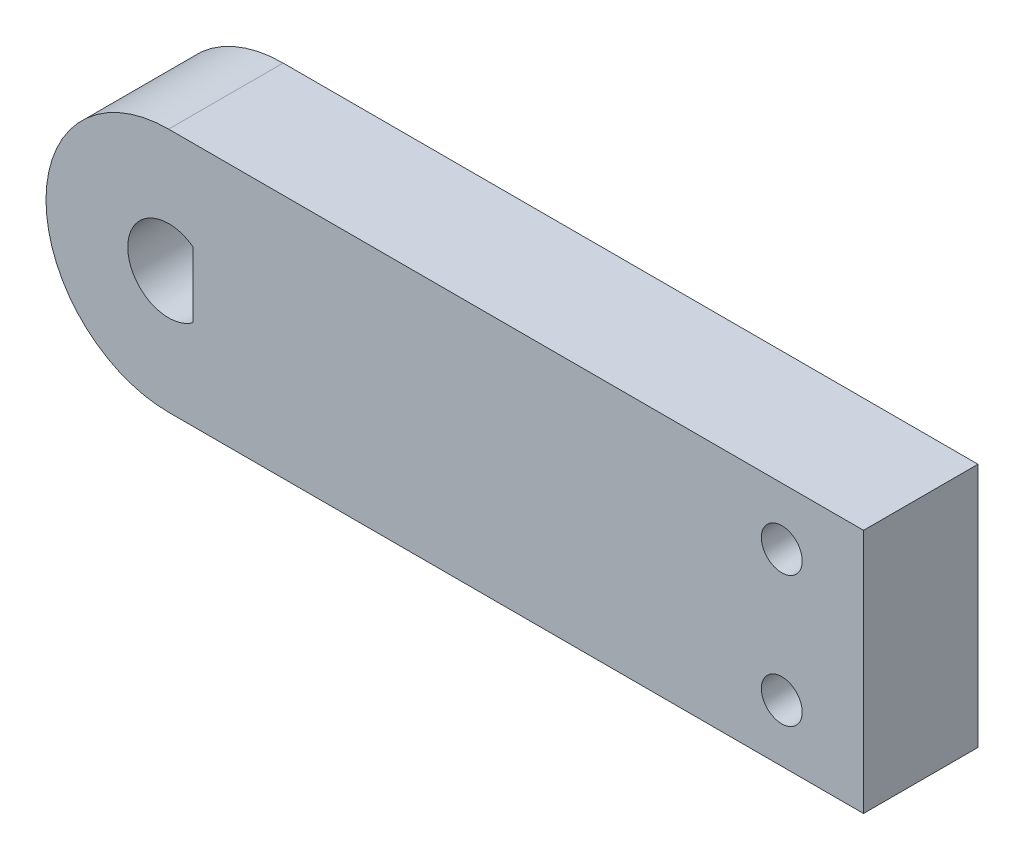
ISO-10303-21;
HEADER;
FILE_DESCRIPTION(('STEP AP214'),'2;1');
FILE_NAME('part.step','',(''),(''),'','','');
FILE_SCHEMA(('AUTOMOTIVE_DESIGN { 1 0 10303 214 1 1 1 1 }'));
ENDSEC;
DATA;
#1=APPLICATION_CONTEXT('core data for automotive mechanical design processes');
#2=APPLICATION_PROTOCOL_DEFINITION('international standard','automotive_design',2000,#1);
#3=PRODUCT_CONTEXT('',#1,'mechanical');
#4=PRODUCT('Part','Part','',(#3));
#5=PRODUCT_RELATED_PRODUCT_CATEGORY('part','',(#4));
#6=PRODUCT_DEFINITION_FORMATION('','',#4);
#7=PRODUCT_DEFINITION_CONTEXT('part definition',#1,'design');
#8=PRODUCT_DEFINITION('design','',#6,#7);
#9=PRODUCT_DEFINITION_SHAPE('','',#8);
#10=(LENGTH_UNIT() NAMED_UNIT(*) SI_UNIT(.MILLI.,.METRE.));
#11=(NAMED_UNIT(*) PLANE_ANGLE_UNIT() SI_UNIT($,.RADIAN.));
#12=(NAMED_UNIT(*) SI_UNIT($,.STERADIAN.) SOLID_ANGLE_UNIT());
#13=UNCERTAINTY_MEASURE_WITH_UNIT(LENGTH_MEASURE(1.E-05),#10,'distance_accuracy_value','');
#14=(GEOMETRIC_REPRESENTATION_CONTEXT(3) GLOBAL_UNCERTAINTY_ASSIGNED_CONTEXT((#13)) GLOBAL_UNIT_ASSIGNED_CONTEXT((#10,
#11,#12)) REPRESENTATION_CONTEXT('',''));
#15=CARTESIAN_POINT('',(0.,0.,0.));
#16=DIRECTION('',(0.,0.,1.));
#17=DIRECTION('',(1.,0.,0.));
#18=AXIS2_PLACEMENT_3D('',#15,#16,#17);
#19=CARTESIAN_POINT('',(31.75,-9.525,4.445));
#20=DIRECTION('',(-1.,0.,0.));
#21=DIRECTION('',(0.,0.,1.));
#22=AXIS2_PLACEMENT_3D('',#19,#20,#21);
#23=PLANE('',#22);
#24=DIRECTION('',(0.,1.,0.));
#25=VECTOR('',#24,1.);
#26=CARTESIAN_POINT('',(31.75,-9.525,-4.445));
#27=LINE('',#26,#25);
#28=CARTESIAN_POINT('',(31.75,-9.525,-4.445));
#29=VERTEX_POINT('',#28);
#30=CARTESIAN_POINT('',(31.75,9.525,-4.445));
#31=VERTEX_POINT('',#30);
#32=EDGE_CURVE('E148',#29,#31,#27,.T.);
#33=ORIENTED_EDGE('',*,*,#32,.T.);
#34=DIRECTION('',(0.,0.,-1.));
#35=VECTOR('',#34,1.);
#36=CARTESIAN_POINT('',(31.75,9.525,4.445));
#37=LINE('',#36,#35);
#38=CARTESIAN_POINT('',(31.75,9.525,4.445));
#39=VERTEX_POINT('',#38);
#40=EDGE_CURVE('E156',#39,#31,#37,.T.);
#41=ORIENTED_EDGE('',*,*,#40,.F.);
#42=DIRECTION('',(0.,1.,0.));
#43=VECTOR('',#42,1.);
#44=CARTESIAN_POINT('',(31.75,-9.525,4.445));
#45=LINE('',#44,#43);
#46=CARTESIAN_POINT('',(31.75,-9.525,4.445));
#47=VERTEX_POINT('',#46);
#48=EDGE_CURVE('E116',#47,#39,#45,.T.);
#49=ORIENTED_EDGE('',*,*,#48,.F.);
#50=DIRECTION('',(0.,0.,-1.));
#51=VECTOR('',#50,1.);
#52=CARTESIAN_POINT('',(31.75,-9.525,4.445));
#53=LINE('',#52,#51);
#54=EDGE_CURVE('E147',#47,#29,#53,.T.);
#55=ORIENTED_EDGE('',*,*,#54,.T.);
#56=EDGE_LOOP('',(#33,#41,#49,#55));
#57=FACE_BOUND('',#56,.T.);
#58=ADVANCED_FACE('F39',(#57),#23,.F.);
#59=CARTESIAN_POINT('',(-31.75,9.525,4.445));
#60=DIRECTION('',(0.,-1.,0.));
#61=DIRECTION('',(0.,0.,-1.));
#62=AXIS2_PLACEMENT_3D('',#59,#60,#61);
#63=PLANE('',#62);
#64=DIRECTION('',(-1.,0.,0.));
#65=VECTOR('',#64,1.);
#66=CARTESIAN_POINT('',(-31.75,9.525,-4.445));
#67=LINE('',#66,#65);
#68=CARTESIAN_POINT('',(-22.225,9.525,-4.445));
#69=VERTEX_POINT('',#68);
#70=EDGE_CURVE('E107',#31,#69,#67,.T.);
#71=ORIENTED_EDGE('',*,*,#70,.T.);
#72=DIRECTION('',(0.,0.,-1.));
#73=VECTOR('',#72,1.);
#74=CARTESIAN_POINT('',(-22.225,9.525,4.445));
#75=LINE('',#74,#73);
#76=CARTESIAN_POINT('',(-22.225,9.525,4.445));
#77=VERTEX_POINT('',#76);
#78=EDGE_CURVE('E11',#69,#77,#75,.F.);
#79=ORIENTED_EDGE('',*,*,#78,.T.);
#80=DIRECTION('',(-1.,0.,0.));
#81=VECTOR('',#80,1.);
#82=CARTESIAN_POINT('',(-31.75,9.525,4.445));
#83=LINE('',#82,#81);
#84=EDGE_CURVE('E105',#39,#77,#83,.T.);
#85=ORIENTED_EDGE('',*,*,#84,.F.);
#86=ORIENTED_EDGE('',*,*,#40,.T.);
#87=EDGE_LOOP('',(#71,#79,#85,#86));
#88=FACE_BOUND('',#87,.T.);
#89=ADVANCED_FACE('F103',(#88),#63,.F.);
#90=CARTESIAN_POINT('',(-31.75,-9.525,4.445));
#91=DIRECTION('',(0.,1.,0.));
#92=DIRECTION('',(0.,0.,1.));
#93=AXIS2_PLACEMENT_3D('',#90,#91,#92);
#94=PLANE('',#93);
#95=DIRECTION('',(1.,0.,0.));
#96=VECTOR('',#95,1.);
#97=CARTESIAN_POINT('',(-31.75,-9.525,4.445));
#98=LINE('',#97,#96);
#99=CARTESIAN_POINT('',(-22.225,-9.525,4.445));
#100=VERTEX_POINT('',#99);
#101=EDGE_CURVE('E118',#100,#47,#98,.T.);
#102=ORIENTED_EDGE('',*,*,#101,.F.);
#103=DIRECTION('',(0.,0.,-1.));
#104=VECTOR('',#103,1.);
#105=CARTESIAN_POINT('',(-22.225,-9.525,4.445));
#106=LINE('',#105,#104);
#107=CARTESIAN_POINT('',(-22.225,-9.525,-4.445));
#108=VERTEX_POINT('',#107);
#109=EDGE_CURVE('E158',#100,#108,#106,.T.);
#110=ORIENTED_EDGE('',*,*,#109,.T.);
#111=DIRECTION('',(1.,0.,0.));
#112=VECTOR('',#111,1.);
#113=CARTESIAN_POINT('',(-31.75,-9.525,-4.445));
#114=LINE('',#113,#112);
#115=EDGE_CURVE('E144',#108,#29,#114,.T.);
#116=ORIENTED_EDGE('',*,*,#115,.T.);
#117=ORIENTED_EDGE('',*,*,#54,.F.);
#118=EDGE_LOOP('',(#102,#110,#116,#117));
#119=FACE_BOUND('',#118,.T.);
#120=ADVANCED_FACE('F174',(#119),#94,.F.);
#121=CARTESIAN_POINT('',(0.,0.,4.445));
#122=DIRECTION('',(0.,0.,-1.));
#123=DIRECTION('',(-1.,0.,0.));
#124=AXIS2_PLACEMENT_3D('',#121,#122,#123);
#125=PLANE('',#124);
#126=DIRECTION('',(0.,1.,0.));
#127=VECTOR('',#126,1.);
#128=CARTESIAN_POINT('',(-20.32,2.54,4.445));
#129=LINE('',#128,#127);
#130=CARTESIAN_POINT('',(-20.32,-2.54,4.445));
#131=VERTEX_POINT('',#130);
#132=CARTESIAN_POINT('',(-20.32,2.54,4.445));
#133=VERTEX_POINT('',#132);
#134=EDGE_CURVE('E74',#131,#133,#129,.T.);
#135=ORIENTED_EDGE('',*,*,#134,.F.);
#136=CARTESIAN_POINT('',(-22.225,0.,4.445));
#137=DIRECTION('',(0.,0.,1.));
#138=DIRECTION('',(1.,0.,0.));
#139=AXIS2_PLACEMENT_3D('',#136,#137,#138);
#140=CIRCLE('',#139,3.175);
#141=EDGE_CURVE('E43',#133,#131,#140,.T.);
#142=ORIENTED_EDGE('',*,*,#141,.F.);
#143=EDGE_LOOP('',(#135,#142));
#144=FACE_BOUND('',#143,.T.);
#145=CARTESIAN_POINT('',(25.4,5.08,4.445));
#146=DIRECTION('',(0.,0.,1.));
#147=DIRECTION('',(1.,0.,0.));
#148=AXIS2_PLACEMENT_3D('',#145,#146,#147);
#149=CIRCLE('',#148,1.5875);
#150=CARTESIAN_POINT('',(26.9875,5.08,4.445));
#151=VERTEX_POINT('',#150);
#152=EDGE_CURVE('E138',#151,#151,#149,.T.);
#153=ORIENTED_EDGE('',*,*,#152,.F.);
#154=EDGE_LOOP('',(#153));
#155=FACE_BOUND('',#154,.T.);
#156=CARTESIAN_POINT('',(25.4,-5.08,4.445));
#157=DIRECTION('',(0.,0.,1.));
#158=DIRECTION('',(1.,0.,0.));
#159=AXIS2_PLACEMENT_3D('',#156,#157,#158);
#160=CIRCLE('',#159,1.5875);
#161=CARTESIAN_POINT('',(26.9875,-5.08,4.445));
#162=VERTEX_POINT('',#161);
#163=EDGE_CURVE('E130',#162,#162,#160,.T.);
#164=ORIENTED_EDGE('',*,*,#163,.F.);
#165=EDGE_LOOP('',(#164));
#166=FACE_BOUND('',#165,.T.);
#167=CARTESIAN_POINT('',(-22.225,0.,4.445));
#168=DIRECTION('',(0.,0.,-1.));
#169=DIRECTION('',(-1.,0.,0.));
#170=AXIS2_PLACEMENT_3D('',#167,#168,#169);
#171=CIRCLE('',#170,9.525);
#172=CARTESIAN_POINT('',(-31.75,0.,4.445));
#173=VERTEX_POINT('',#172);
#174=EDGE_CURVE('E113',#77,#173,#171,.F.);
#175=ORIENTED_EDGE('',*,*,#174,.T.);
#176=CARTESIAN_POINT('',(-22.225,0.,4.445));
#177=DIRECTION('',(0.,0.,-1.));
#178=DIRECTION('',(-1.,0.,0.));
#179=AXIS2_PLACEMENT_3D('',#176,#177,#178);
#180=CIRCLE('',#179,9.525);
#181=EDGE_CURVE('E48',#173,#100,#180,.F.);
#182=ORIENTED_EDGE('',*,*,#181,.T.);
#183=ORIENTED_EDGE('',*,*,#101,.T.);
#184=ORIENTED_EDGE('',*,*,#48,.T.);
#185=ORIENTED_EDGE('',*,*,#84,.T.);
#186=EDGE_LOOP('',(#175,#182,#183,#184,#185));
#187=FACE_BOUND('',#186,.T.);
#188=ADVANCED_FACE('F112',(#144,#155,#166,#187),#125,.F.);
#189=CARTESIAN_POINT('',(0.,0.,-4.445));
#190=DIRECTION('',(0.,0.,-1.));
#191=DIRECTION('',(-1.,0.,0.));
#192=AXIS2_PLACEMENT_3D('',#189,#190,#191);
#193=PLANE('',#192);
#194=CARTESIAN_POINT('',(-22.225,0.,-4.445));
#195=DIRECTION('',(0.,0.,1.));
#196=DIRECTION('',(1.,0.,0.));
#197=AXIS2_PLACEMENT_3D('',#194,#195,#196);
#198=CIRCLE('',#197,3.175);
#199=CARTESIAN_POINT('',(-20.32,2.54,-4.445));
#200=VERTEX_POINT('',#199);
#201=CARTESIAN_POINT('',(-20.32,-2.54,-4.445));
#202=VERTEX_POINT('',#201);
#203=EDGE_CURVE('E64',#200,#202,#198,.T.);
#204=ORIENTED_EDGE('',*,*,#203,.T.);
#205=DIRECTION('',(0.,1.,0.));
#206=VECTOR('',#205,1.);
#207=CARTESIAN_POINT('',(-20.32,2.54,-4.445));
#208=LINE('',#207,#206);
#209=EDGE_CURVE('E134',#202,#200,#208,.T.);
#210=ORIENTED_EDGE('',*,*,#209,.T.);
#211=EDGE_LOOP('',(#204,#210));
#212=FACE_BOUND('',#211,.T.);
#213=CARTESIAN_POINT('',(25.4,5.08,-4.445));
#214=DIRECTION('',(0.,0.,-1.));
#215=DIRECTION('',(-1.,0.,0.));
#216=AXIS2_PLACEMENT_3D('',#213,#214,#215);
#217=CIRCLE('',#216,1.5875);
#218=CARTESIAN_POINT('',(23.8125,5.08,-4.445));
#219=VERTEX_POINT('',#218);
#220=EDGE_CURVE('E151',#219,#219,#217,.T.);
#221=ORIENTED_EDGE('',*,*,#220,.F.);
#222=EDGE_LOOP('',(#221));
#223=FACE_BOUND('',#222,.T.);
#224=CARTESIAN_POINT('',(25.4,-5.08,-4.445));
#225=DIRECTION('',(0.,0.,-1.));
#226=DIRECTION('',(-1.,0.,0.));
#227=AXIS2_PLACEMENT_3D('',#224,#225,#226);
#228=CIRCLE('',#227,1.5875);
#229=CARTESIAN_POINT('',(23.8125,-5.08,-4.445));
#230=VERTEX_POINT('',#229);
#231=EDGE_CURVE('E141',#230,#230,#228,.T.);
#232=ORIENTED_EDGE('',*,*,#231,.F.);
#233=EDGE_LOOP('',(#232));
#234=FACE_BOUND('',#233,.T.);
#235=ORIENTED_EDGE('',*,*,#115,.F.);
#236=CARTESIAN_POINT('',(-22.225,0.,-4.445));
#237=DIRECTION('',(0.,0.,-1.));
#238=DIRECTION('',(-1.,0.,0.));
#239=AXIS2_PLACEMENT_3D('',#236,#237,#238);
#240=CIRCLE('',#239,9.525);
#241=CARTESIAN_POINT('',(-31.75,0.,-4.445));
#242=VERTEX_POINT('',#241);
#243=EDGE_CURVE('E123',#108,#242,#240,.T.);
#244=ORIENTED_EDGE('',*,*,#243,.T.);
#245=CARTESIAN_POINT('',(-22.225,0.,-4.445));
#246=DIRECTION('',(0.,0.,-1.));
#247=DIRECTION('',(-1.,0.,0.));
#248=AXIS2_PLACEMENT_3D('',#245,#246,#247);
#249=CIRCLE('',#248,9.525);
#250=EDGE_CURVE('E126',#242,#69,#249,.T.);
#251=ORIENTED_EDGE('',*,*,#250,.T.);
#252=ORIENTED_EDGE('',*,*,#70,.F.);
#253=ORIENTED_EDGE('',*,*,#32,.F.);
#254=EDGE_LOOP('',(#235,#244,#251,#252,#253));
#255=FACE_BOUND('',#254,.T.);
#256=ADVANCED_FACE('F166',(#212,#223,#234,#255),#193,.T.);
#257=CARTESIAN_POINT('',(25.4,-5.08,-8.255));
#258=DIRECTION('',(0.,0.,1.));
#259=DIRECTION('',(1.,0.,0.));
#260=AXIS2_PLACEMENT_3D('',#257,#258,#259);
#261=CYLINDRICAL_SURFACE('',#260,1.5875);
#262=ORIENTED_EDGE('',*,*,#231,.T.);
#263=EDGE_LOOP('',(#262));
#264=FACE_BOUND('',#263,.T.);
#265=ORIENTED_EDGE('',*,*,#163,.T.);
#266=EDGE_LOOP('',(#265));
#267=FACE_BOUND('',#266,.T.);
#268=ADVANCED_FACE('F195',(#264,#267),#261,.F.);
#269=CARTESIAN_POINT('',(25.4,5.08,-8.255));
#270=DIRECTION('',(0.,0.,1.));
#271=DIRECTION('',(1.,0.,0.));
#272=AXIS2_PLACEMENT_3D('',#269,#270,#271);
#273=CYLINDRICAL_SURFACE('',#272,1.5875);
#274=ORIENTED_EDGE('',*,*,#220,.T.);
#275=EDGE_LOOP('',(#274));
#276=FACE_BOUND('',#275,.T.);
#277=ORIENTED_EDGE('',*,*,#152,.T.);
#278=EDGE_LOOP('',(#277));
#279=FACE_BOUND('',#278,.T.);
#280=ADVANCED_FACE('F191',(#276,#279),#273,.F.);
#281=CARTESIAN_POINT('',(-22.225,0.,4.445));
#282=DIRECTION('',(0.,0.,-1.));
#283=DIRECTION('',(-1.,0.,0.));
#284=AXIS2_PLACEMENT_3D('',#281,#282,#283);
#285=CYLINDRICAL_SURFACE('',#284,9.525);
#286=DIRECTION('',(0.,0.,-1.));
#287=VECTOR('',#286,1.);
#288=CARTESIAN_POINT('',(-31.75,0.,4.445));
#289=LINE('',#288,#287);
#290=EDGE_CURVE('E121',#173,#242,#289,.T.);
#291=ORIENTED_EDGE('',*,*,#290,.F.);
#292=ORIENTED_EDGE('',*,*,#174,.F.);
#293=ORIENTED_EDGE('',*,*,#78,.F.);
#294=ORIENTED_EDGE('',*,*,#250,.F.);
#295=EDGE_LOOP('',(#291,#292,#293,#294));
#296=FACE_BOUND('',#295,.T.);
#297=ADVANCED_FACE('F41',(#296),#285,.T.);
#298=CARTESIAN_POINT('',(-22.225,0.,4.445));
#299=DIRECTION('',(0.,0.,-1.));
#300=DIRECTION('',(-1.,0.,0.));
#301=AXIS2_PLACEMENT_3D('',#298,#299,#300);
#302=CYLINDRICAL_SURFACE('',#301,9.525);
#303=ORIENTED_EDGE('',*,*,#181,.F.);
#304=ORIENTED_EDGE('',*,*,#290,.T.);
#305=ORIENTED_EDGE('',*,*,#243,.F.);
#306=ORIENTED_EDGE('',*,*,#109,.F.);
#307=EDGE_LOOP('',(#303,#304,#305,#306));
#308=FACE_BOUND('',#307,.T.);
#309=ADVANCED_FACE('F169',(#308),#302,.T.);
#310=CARTESIAN_POINT('',(-22.225,0.,-4.445));
#311=DIRECTION('',(0.,0.,1.));
#312=DIRECTION('',(1.,0.,0.));
#313=AXIS2_PLACEMENT_3D('',#310,#311,#312);
#314=CYLINDRICAL_SURFACE('',#313,3.175);
#315=DIRECTION('',(0.,0.,1.));
#316=VECTOR('',#315,1.);
#317=CARTESIAN_POINT('',(-20.32,-2.54,-4.445));
#318=LINE('',#317,#316);
#319=EDGE_CURVE('E56',#202,#131,#318,.T.);
#320=ORIENTED_EDGE('',*,*,#319,.F.);
#321=ORIENTED_EDGE('',*,*,#203,.F.);
#322=DIRECTION('',(0.,0.,1.));
#323=VECTOR('',#322,1.);
#324=CARTESIAN_POINT('',(-20.32,2.54,-4.445));
#325=LINE('',#324,#323);
#326=EDGE_CURVE('E131',#200,#133,#325,.T.);
#327=ORIENTED_EDGE('',*,*,#326,.T.);
#328=ORIENTED_EDGE('',*,*,#141,.T.);
#329=EDGE_LOOP('',(#320,#321,#327,#328));
#330=FACE_BOUND('',#329,.T.);
#331=ADVANCED_FACE('F184',(#330),#314,.F.);
#332=CARTESIAN_POINT('',(-20.32,2.54,-4.445));
#333=DIRECTION('',(1.,0.,0.));
#334=DIRECTION('',(0.,0.,-1.));
#335=AXIS2_PLACEMENT_3D('',#332,#333,#334);
#336=PLANE('',#335);
#337=ORIENTED_EDGE('',*,*,#326,.F.);
#338=ORIENTED_EDGE('',*,*,#209,.F.);
#339=ORIENTED_EDGE('',*,*,#319,.T.);
#340=ORIENTED_EDGE('',*,*,#134,.T.);
#341=EDGE_LOOP('',(#337,#338,#339,#340));
#342=FACE_BOUND('',#341,.T.);
#343=ADVANCED_FACE('F189',(#342),#336,.F.);
#344=CLOSED_SHELL('',(#58,#89,#120,#188,#256,#268,#280,#297,#309,#331,#343));
#345=MANIFOLD_SOLID_BREP('B2',#344);
#346=ADVANCED_BREP_SHAPE_REPRESENTATION('',(#18,#345),#14);
#347=SHAPE_DEFINITION_REPRESENTATION(#9,#346);
ENDSEC;
END-ISO-10303-21;
